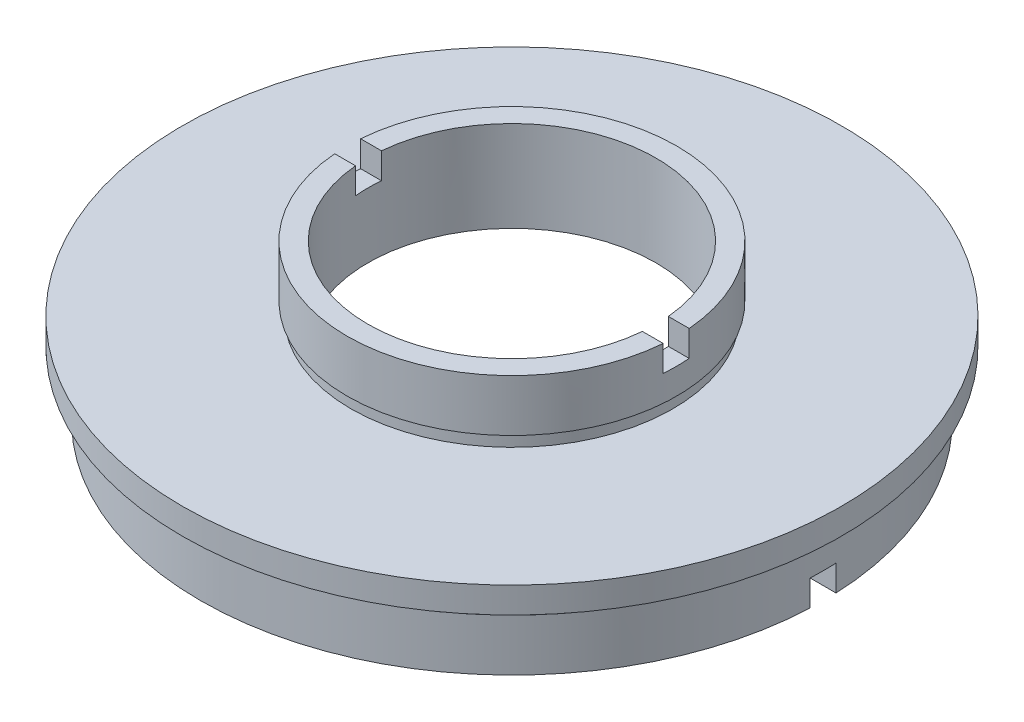
ISO-10303-21;
HEADER;
FILE_DESCRIPTION(('STEP AP214'),'2;1');
FILE_NAME('part.step','',(''),(''),'','','');
FILE_SCHEMA(('AUTOMOTIVE_DESIGN { 1 0 10303 214 1 1 1 1 }'));
ENDSEC;
DATA;
#1=APPLICATION_CONTEXT('core data for automotive mechanical design processes');
#2=APPLICATION_PROTOCOL_DEFINITION('international standard','automotive_design',2000,#1);
#3=PRODUCT_CONTEXT('',#1,'mechanical');
#4=PRODUCT('Part','Part','',(#3));
#5=PRODUCT_RELATED_PRODUCT_CATEGORY('part','',(#4));
#6=PRODUCT_DEFINITION_FORMATION('','',#4);
#7=PRODUCT_DEFINITION_CONTEXT('part definition',#1,'design');
#8=PRODUCT_DEFINITION('design','',#6,#7);
#9=PRODUCT_DEFINITION_SHAPE('','',#8);
#10=(LENGTH_UNIT() NAMED_UNIT(*) SI_UNIT(.MILLI.,.METRE.));
#11=(NAMED_UNIT(*) PLANE_ANGLE_UNIT() SI_UNIT($,.RADIAN.));
#12=(NAMED_UNIT(*) SI_UNIT($,.STERADIAN.) SOLID_ANGLE_UNIT());
#13=UNCERTAINTY_MEASURE_WITH_UNIT(LENGTH_MEASURE(1.E-05),#10,'distance_accuracy_value','');
#14=(GEOMETRIC_REPRESENTATION_CONTEXT(3) GLOBAL_UNCERTAINTY_ASSIGNED_CONTEXT((#13)) GLOBAL_UNIT_ASSIGNED_CONTEXT((#10,
#11,#12)) REPRESENTATION_CONTEXT('',''));
#15=CARTESIAN_POINT('',(0.,0.,0.));
#16=DIRECTION('',(0.,0.,1.));
#17=DIRECTION('',(1.,0.,0.));
#18=AXIS2_PLACEMENT_3D('',#15,#16,#17);
#19=CARTESIAN_POINT('',(-24.,0.,0.));
#20=DIRECTION('',(0.,-1.,0.));
#21=DIRECTION('',(0.,0.,-1.));
#22=AXIS2_PLACEMENT_3D('',#19,#20,#21);
#23=PLANE('',#22);
#24=DIRECTION('',(-1.,0.,0.));
#25=VECTOR('',#24,1.);
#26=CARTESIAN_POINT('',(-24.,0.,1.));
#27=LINE('',#26,#25);
#28=CARTESIAN_POINT('',(23.9791576165636,0.,1.));
#29=VERTEX_POINT('',#28);
#30=CARTESIAN_POINT('',(20.4755952294433,0.,1.));
#31=VERTEX_POINT('',#30);
#32=EDGE_CURVE('E183',#29,#31,#27,.T.);
#33=ORIENTED_EDGE('',*,*,#32,.F.);
#34=CARTESIAN_POINT('',(0.,0.,0.));
#35=DIRECTION('',(0.,1.,0.));
#36=DIRECTION('',(0.,0.,1.));
#37=AXIS2_PLACEMENT_3D('',#34,#35,#36);
#38=CIRCLE('',#37,24.);
#39=CARTESIAN_POINT('',(-23.9791576165636,0.,1.));
#40=VERTEX_POINT('',#39);
#41=EDGE_CURVE('E238',#40,#29,#38,.T.);
#42=ORIENTED_EDGE('',*,*,#41,.F.);
#43=CARTESIAN_POINT('',(-20.4755952294433,0.,1.));
#44=VERTEX_POINT('',#43);
#45=EDGE_CURVE('E161',#44,#40,#27,.T.);
#46=ORIENTED_EDGE('',*,*,#45,.F.);
#47=CARTESIAN_POINT('',(0.,0.,0.));
#48=DIRECTION('',(0.,1.,0.));
#49=DIRECTION('',(0.,0.,1.));
#50=AXIS2_PLACEMENT_3D('',#47,#48,#49);
#51=CIRCLE('',#50,20.5);
#52=EDGE_CURVE('E234',#44,#31,#51,.T.);
#53=ORIENTED_EDGE('',*,*,#52,.T.);
#54=EDGE_LOOP('',(#33,#42,#46,#53));
#55=FACE_BOUND('',#54,.T.);
#56=ADVANCED_FACE('F38',(#55),#23,.T.);
#57=CARTESIAN_POINT('',(-11.1,12.,0.));
#58=DIRECTION('',(0.,1.,0.));
#59=DIRECTION('',(0.,0.,1.));
#60=AXIS2_PLACEMENT_3D('',#57,#58,#59);
#61=PLANE('',#60);
#62=DIRECTION('',(1.,0.,0.));
#63=VECTOR('',#62,1.);
#64=CARTESIAN_POINT('',(-11.1,12.,1.));
#65=LINE('',#64,#63);
#66=CARTESIAN_POINT('',(-12.6605687076055,12.,1.));
#67=VERTEX_POINT('',#66);
#68=CARTESIAN_POINT('',(-11.054863183233,12.,1.));
#69=VERTEX_POINT('',#68);
#70=EDGE_CURVE('E270',#67,#69,#65,.T.);
#71=ORIENTED_EDGE('',*,*,#70,.F.);
#72=CARTESIAN_POINT('',(0.,12.,0.));
#73=DIRECTION('',(0.,1.,0.));
#74=DIRECTION('',(0.,0.,1.));
#75=AXIS2_PLACEMENT_3D('',#72,#73,#74);
#76=CIRCLE('',#75,12.7);
#77=CARTESIAN_POINT('',(12.6605687076055,12.,1.));
#78=VERTEX_POINT('',#77);
#79=EDGE_CURVE('E214',#67,#78,#76,.T.);
#80=ORIENTED_EDGE('',*,*,#79,.T.);
#81=CARTESIAN_POINT('',(11.054863183233,12.,1.));
#82=VERTEX_POINT('',#81);
#83=EDGE_CURVE('E268',#82,#78,#65,.T.);
#84=ORIENTED_EDGE('',*,*,#83,.F.);
#85=CARTESIAN_POINT('',(0.,12.,0.));
#86=DIRECTION('',(0.,1.,0.));
#87=DIRECTION('',(0.,0.,1.));
#88=AXIS2_PLACEMENT_3D('',#85,#86,#87);
#89=CIRCLE('',#88,11.1);
#90=EDGE_CURVE('E218',#69,#82,#89,.T.);
#91=ORIENTED_EDGE('',*,*,#90,.F.);
#92=EDGE_LOOP('',(#71,#80,#84,#91));
#93=FACE_BOUND('',#92,.T.);
#94=ADVANCED_FACE('F319',(#93),#61,.T.);
#95=CARTESIAN_POINT('',(0.,22.6774994510759,0.));
#96=DIRECTION('',(0.,1.,0.));
#97=DIRECTION('',(0.,0.,1.));
#98=AXIS2_PLACEMENT_3D('',#95,#96,#97);
#99=CYLINDRICAL_SURFACE('',#98,12.7);
#100=DIRECTION('',(0.,1.,0.));
#101=VECTOR('',#100,1.);
#102=CARTESIAN_POINT('',(-12.6605687076055,22.6774994510759,1.));
#103=LINE('',#102,#101);
#104=CARTESIAN_POINT('',(-12.6605687076055,10.,1.));
#105=VERTEX_POINT('',#104);
#106=EDGE_CURVE('E209',#105,#67,#103,.T.);
#107=ORIENTED_EDGE('',*,*,#106,.F.);
#108=CARTESIAN_POINT('',(0.,10.,0.));
#109=DIRECTION('',(0.,-1.,0.));
#110=DIRECTION('',(0.,0.,-1.));
#111=AXIS2_PLACEMENT_3D('',#108,#109,#110);
#112=CIRCLE('',#111,12.7);
#113=CARTESIAN_POINT('',(-12.6605687076055,10.,-0.999999999999997));
#114=VERTEX_POINT('',#113);
#115=EDGE_CURVE('E213',#114,#105,#112,.F.);
#116=ORIENTED_EDGE('',*,*,#115,.F.);
#117=DIRECTION('',(0.,1.,0.));
#118=VECTOR('',#117,1.);
#119=CARTESIAN_POINT('',(-12.6605687076055,22.6774994510759,-1.));
#120=LINE('',#119,#118);
#121=CARTESIAN_POINT('',(-12.6605687076055,12.,-0.999999999999998));
#122=VERTEX_POINT('',#121);
#123=EDGE_CURVE('E197',#122,#114,#120,.F.);
#124=ORIENTED_EDGE('',*,*,#123,.F.);
#125=CARTESIAN_POINT('',(12.6605687076055,12.,-0.999999999999998));
#126=VERTEX_POINT('',#125);
#127=EDGE_CURVE('E217',#126,#122,#76,.T.);
#128=ORIENTED_EDGE('',*,*,#127,.F.);
#129=DIRECTION('',(0.,1.,0.));
#130=VECTOR('',#129,1.);
#131=CARTESIAN_POINT('',(12.6605687076055,22.6774994510759,-1.));
#132=LINE('',#131,#130);
#133=CARTESIAN_POINT('',(12.6605687076055,10.,-0.999999999999997));
#134=VERTEX_POINT('',#133);
#135=EDGE_CURVE('E201',#134,#126,#132,.T.);
#136=ORIENTED_EDGE('',*,*,#135,.F.);
#137=CARTESIAN_POINT('',(12.6605687076055,10.,1.));
#138=VERTEX_POINT('',#137);
#139=EDGE_CURVE('E211',#138,#134,#112,.F.);
#140=ORIENTED_EDGE('',*,*,#139,.F.);
#141=DIRECTION('',(0.,1.,0.));
#142=VECTOR('',#141,1.);
#143=CARTESIAN_POINT('',(12.6605687076055,22.6774994510759,1.));
#144=LINE('',#143,#142);
#145=EDGE_CURVE('E205',#78,#138,#144,.F.);
#146=ORIENTED_EDGE('',*,*,#145,.F.);
#147=ORIENTED_EDGE('',*,*,#79,.F.);
#148=EDGE_LOOP('',(#107,#116,#124,#128,#136,#140,#146,#147));
#149=FACE_BOUND('',#148,.T.);
#150=CARTESIAN_POINT('',(0.,8.,0.));
#151=DIRECTION('',(0.,1.,0.));
#152=DIRECTION('',(0.,0.,1.));
#153=AXIS2_PLACEMENT_3D('',#150,#151,#152);
#154=CIRCLE('',#153,12.7);
#155=CARTESIAN_POINT('',(0.,8.,12.7));
#156=VERTEX_POINT('',#155);
#157=EDGE_CURVE('E262',#156,#156,#154,.T.);
#158=ORIENTED_EDGE('',*,*,#157,.T.);
#159=EDGE_LOOP('',(#158));
#160=FACE_BOUND('',#159,.T.);
#161=ADVANCED_FACE('F40',(#149,#160),#99,.T.);
#162=CARTESIAN_POINT('',(-12.7,8.,0.));
#163=DIRECTION('',(0.,-1.,0.));
#164=DIRECTION('',(0.,0.,-1.));
#165=AXIS2_PLACEMENT_3D('',#162,#163,#164);
#166=PLANE('',#165);
#167=CARTESIAN_POINT('',(0.,8.,0.));
#168=DIRECTION('',(0.,1.,0.));
#169=DIRECTION('',(0.,0.,1.));
#170=AXIS2_PLACEMENT_3D('',#167,#168,#169);
#171=CIRCLE('',#170,12.4);
#172=CARTESIAN_POINT('',(0.,8.,12.4));
#173=VERTEX_POINT('',#172);
#174=EDGE_CURVE('E259',#173,#173,#171,.T.);
#175=ORIENTED_EDGE('',*,*,#174,.T.);
#176=EDGE_LOOP('',(#175));
#177=FACE_BOUND('',#176,.T.);
#178=ORIENTED_EDGE('',*,*,#157,.F.);
#179=EDGE_LOOP('',(#178));
#180=FACE_BOUND('',#179,.T.);
#181=ADVANCED_FACE('F329',(#177,#180),#166,.T.);
#182=CARTESIAN_POINT('',(0.,22.6774994510759,0.));
#183=DIRECTION('',(0.,1.,0.));
#184=DIRECTION('',(0.,0.,1.));
#185=AXIS2_PLACEMENT_3D('',#182,#183,#184);
#186=CYLINDRICAL_SURFACE('',#185,12.4);
#187=CARTESIAN_POINT('',(0.,7.,0.));
#188=DIRECTION('',(0.,1.,0.));
#189=DIRECTION('',(0.,0.,1.));
#190=AXIS2_PLACEMENT_3D('',#187,#188,#189);
#191=CIRCLE('',#190,12.4);
#192=CARTESIAN_POINT('',(0.,7.,12.4));
#193=VERTEX_POINT('',#192);
#194=EDGE_CURVE('E256',#193,#193,#191,.T.);
#195=ORIENTED_EDGE('',*,*,#194,.T.);
#196=EDGE_LOOP('',(#195));
#197=FACE_BOUND('',#196,.T.);
#198=ORIENTED_EDGE('',*,*,#174,.F.);
#199=EDGE_LOOP('',(#198));
#200=FACE_BOUND('',#199,.T.);
#201=ADVANCED_FACE('F569',(#197,#200),#186,.T.);
#202=CARTESIAN_POINT('',(-12.4,7.,0.));
#203=DIRECTION('',(0.,1.,0.));
#204=DIRECTION('',(0.,0.,1.));
#205=AXIS2_PLACEMENT_3D('',#202,#203,#204);
#206=PLANE('',#205);
#207=CARTESIAN_POINT('',(0.,7.,0.));
#208=DIRECTION('',(0.,1.,0.));
#209=DIRECTION('',(0.,0.,1.));
#210=AXIS2_PLACEMENT_3D('',#207,#208,#209);
#211=CIRCLE('',#210,25.4);
#212=CARTESIAN_POINT('',(0.,7.,25.4));
#213=VERTEX_POINT('',#212);
#214=EDGE_CURVE('E253',#213,#213,#211,.T.);
#215=ORIENTED_EDGE('',*,*,#214,.T.);
#216=EDGE_LOOP('',(#215));
#217=FACE_BOUND('',#216,.T.);
#218=ORIENTED_EDGE('',*,*,#194,.F.);
#219=EDGE_LOOP('',(#218));
#220=FACE_BOUND('',#219,.T.);
#221=ADVANCED_FACE('F560',(#217,#220),#206,.T.);
#222=CARTESIAN_POINT('',(0.,22.6774994510759,0.));
#223=DIRECTION('',(0.,1.,0.));
#224=DIRECTION('',(0.,0.,1.));
#225=AXIS2_PLACEMENT_3D('',#222,#223,#224);
#226=CYLINDRICAL_SURFACE('',#225,25.4);
#227=CARTESIAN_POINT('',(0.,5.,0.));
#228=DIRECTION('',(0.,1.,0.));
#229=DIRECTION('',(0.,0.,1.));
#230=AXIS2_PLACEMENT_3D('',#227,#228,#229);
#231=CIRCLE('',#230,25.4);
#232=CARTESIAN_POINT('',(0.,5.,25.4));
#233=VERTEX_POINT('',#232);
#234=EDGE_CURVE('E250',#233,#233,#231,.T.);
#235=ORIENTED_EDGE('',*,*,#234,.T.);
#236=EDGE_LOOP('',(#235));
#237=FACE_BOUND('',#236,.T.);
#238=ORIENTED_EDGE('',*,*,#214,.F.);
#239=EDGE_LOOP('',(#238));
#240=FACE_BOUND('',#239,.T.);
#241=ADVANCED_FACE('F551',(#237,#240),#226,.T.);
#242=CARTESIAN_POINT('',(-25.4,5.,0.));
#243=DIRECTION('',(0.,-1.,0.));
#244=DIRECTION('',(0.,0.,-1.));
#245=AXIS2_PLACEMENT_3D('',#242,#243,#244);
#246=PLANE('',#245);
#247=CARTESIAN_POINT('',(0.,5.,0.));
#248=DIRECTION('',(0.,1.,0.));
#249=DIRECTION('',(0.,0.,1.));
#250=AXIS2_PLACEMENT_3D('',#247,#248,#249);
#251=CIRCLE('',#250,23.5);
#252=CARTESIAN_POINT('',(0.,5.,23.5));
#253=VERTEX_POINT('',#252);
#254=EDGE_CURVE('E247',#253,#253,#251,.T.);
#255=ORIENTED_EDGE('',*,*,#254,.T.);
#256=EDGE_LOOP('',(#255));
#257=FACE_BOUND('',#256,.T.);
#258=ORIENTED_EDGE('',*,*,#234,.F.);
#259=EDGE_LOOP('',(#258));
#260=FACE_BOUND('',#259,.T.);
#261=ADVANCED_FACE('F542',(#257,#260),#246,.T.);
#262=CARTESIAN_POINT('',(0.,22.6774994510759,0.));
#263=DIRECTION('',(0.,1.,0.));
#264=DIRECTION('',(0.,0.,1.));
#265=AXIS2_PLACEMENT_3D('',#262,#263,#264);
#266=CYLINDRICAL_SURFACE('',#265,23.5);
#267=CARTESIAN_POINT('',(0.,4.,0.));
#268=DIRECTION('',(0.,1.,0.));
#269=DIRECTION('',(0.,0.,1.));
#270=AXIS2_PLACEMENT_3D('',#267,#268,#269);
#271=CIRCLE('',#270,23.5);
#272=CARTESIAN_POINT('',(0.,4.,23.5));
#273=VERTEX_POINT('',#272);
#274=EDGE_CURVE('E244',#273,#273,#271,.T.);
#275=ORIENTED_EDGE('',*,*,#274,.T.);
#276=EDGE_LOOP('',(#275));
#277=FACE_BOUND('',#276,.T.);
#278=ORIENTED_EDGE('',*,*,#254,.F.);
#279=EDGE_LOOP('',(#278));
#280=FACE_BOUND('',#279,.T.);
#281=ADVANCED_FACE('F533',(#277,#280),#266,.T.);
#282=CARTESIAN_POINT('',(-23.5,4.,0.));
#283=DIRECTION('',(0.,1.,0.));
#284=DIRECTION('',(0.,0.,1.));
#285=AXIS2_PLACEMENT_3D('',#282,#283,#284);
#286=PLANE('',#285);
#287=CARTESIAN_POINT('',(0.,4.,0.));
#288=DIRECTION('',(0.,1.,0.));
#289=DIRECTION('',(0.,0.,1.));
#290=AXIS2_PLACEMENT_3D('',#287,#288,#289);
#291=CIRCLE('',#290,24.);
#292=CARTESIAN_POINT('',(0.,4.,24.));
#293=VERTEX_POINT('',#292);
#294=EDGE_CURVE('E241',#293,#293,#291,.T.);
#295=ORIENTED_EDGE('',*,*,#294,.T.);
#296=EDGE_LOOP('',(#295));
#297=FACE_BOUND('',#296,.T.);
#298=ORIENTED_EDGE('',*,*,#274,.F.);
#299=EDGE_LOOP('',(#298));
#300=FACE_BOUND('',#299,.T.);
#301=ADVANCED_FACE('F316',(#297,#300),#286,.T.);
#302=CARTESIAN_POINT('',(0.,22.6774994510759,0.));
#303=DIRECTION('',(0.,1.,0.));
#304=DIRECTION('',(0.,0.,1.));
#305=AXIS2_PLACEMENT_3D('',#302,#303,#304);
#306=CYLINDRICAL_SURFACE('',#305,24.);
#307=DIRECTION('',(0.,1.,0.));
#308=VECTOR('',#307,1.);
#309=CARTESIAN_POINT('',(-23.9791576165636,22.6774994510759,1.));
#310=LINE('',#309,#308);
#311=CARTESIAN_POINT('',(-23.9791576165636,2.,1.));
#312=VERTEX_POINT('',#311);
#313=EDGE_CURVE('E182',#40,#312,#310,.T.);
#314=ORIENTED_EDGE('',*,*,#313,.F.);
#315=ORIENTED_EDGE('',*,*,#41,.T.);
#316=DIRECTION('',(0.,1.,0.));
#317=VECTOR('',#316,1.);
#318=CARTESIAN_POINT('',(23.9791576165636,22.6774994510759,1.));
#319=LINE('',#318,#317);
#320=CARTESIAN_POINT('',(23.9791576165636,2.,1.));
#321=VERTEX_POINT('',#320);
#322=EDGE_CURVE('E185',#321,#29,#319,.F.);
#323=ORIENTED_EDGE('',*,*,#322,.F.);
#324=CARTESIAN_POINT('',(0.,2.,0.));
#325=DIRECTION('',(0.,1.,0.));
#326=DIRECTION('',(0.,0.,1.));
#327=AXIS2_PLACEMENT_3D('',#324,#325,#326);
#328=CIRCLE('',#327,24.);
#329=CARTESIAN_POINT('',(23.9791576165636,2.,-1.));
#330=VERTEX_POINT('',#329);
#331=EDGE_CURVE('E162',#330,#321,#328,.F.);
#332=ORIENTED_EDGE('',*,*,#331,.F.);
#333=DIRECTION('',(0.,1.,0.));
#334=VECTOR('',#333,1.);
#335=CARTESIAN_POINT('',(23.9791576165636,22.6774994510759,-0.999999999999994));
#336=LINE('',#335,#334);
#337=CARTESIAN_POINT('',(23.9791576165636,0.,-1.));
#338=VERTEX_POINT('',#337);
#339=EDGE_CURVE('E176',#338,#330,#336,.T.);
#340=ORIENTED_EDGE('',*,*,#339,.F.);
#341=CARTESIAN_POINT('',(-23.9791576165636,0.,-1.));
#342=VERTEX_POINT('',#341);
#343=EDGE_CURVE('E174',#338,#342,#38,.T.);
#344=ORIENTED_EDGE('',*,*,#343,.T.);
#345=DIRECTION('',(0.,1.,0.));
#346=VECTOR('',#345,1.);
#347=CARTESIAN_POINT('',(-23.9791576165636,22.6774994510759,-0.999999999999994));
#348=LINE('',#347,#346);
#349=CARTESIAN_POINT('',(-23.9791576165636,2.,-1.));
#350=VERTEX_POINT('',#349);
#351=EDGE_CURVE('E165',#350,#342,#348,.F.);
#352=ORIENTED_EDGE('',*,*,#351,.F.);
#353=EDGE_CURVE('E151',#312,#350,#328,.F.);
#354=ORIENTED_EDGE('',*,*,#353,.F.);
#355=EDGE_LOOP('',(#314,#315,#323,#332,#340,#344,#352,#354));
#356=FACE_BOUND('',#355,.T.);
#357=ORIENTED_EDGE('',*,*,#294,.F.);
#358=EDGE_LOOP('',(#357));
#359=FACE_BOUND('',#358,.T.);
#360=ADVANCED_FACE('F170',(#356,#359),#306,.T.);
#361=DIRECTION('',(1.,0.,0.));
#362=VECTOR('',#361,1.);
#363=CARTESIAN_POINT('',(-24.,0.,-1.));
#364=LINE('',#363,#362);
#365=CARTESIAN_POINT('',(-20.4755952294433,0.,-0.999999999999995));
#366=VERTEX_POINT('',#365);
#367=EDGE_CURVE('E61',#342,#366,#364,.T.);
#368=ORIENTED_EDGE('',*,*,#367,.F.);
#369=ORIENTED_EDGE('',*,*,#343,.F.);
#370=CARTESIAN_POINT('',(20.4755952294433,0.,-0.999999999999994));
#371=VERTEX_POINT('',#370);
#372=EDGE_CURVE('E178',#371,#338,#364,.T.);
#373=ORIENTED_EDGE('',*,*,#372,.F.);
#374=EDGE_CURVE('E237',#371,#366,#51,.T.);
#375=ORIENTED_EDGE('',*,*,#374,.T.);
#376=EDGE_LOOP('',(#368,#369,#373,#375));
#377=FACE_BOUND('',#376,.T.);
#378=ADVANCED_FACE('F307',(#377),#23,.T.);
#379=CARTESIAN_POINT('',(0.,22.6774994510759,0.));
#380=DIRECTION('',(0.,1.,0.));
#381=DIRECTION('',(0.,0.,1.));
#382=AXIS2_PLACEMENT_3D('',#379,#380,#381);
#383=CYLINDRICAL_SURFACE('',#382,20.5);
#384=DIRECTION('',(0.,1.,0.));
#385=VECTOR('',#384,1.);
#386=CARTESIAN_POINT('',(-20.4755952294433,22.6774994510759,1.));
#387=LINE('',#386,#385);
#388=CARTESIAN_POINT('',(-20.4755952294433,2.,1.));
#389=VERTEX_POINT('',#388);
#390=EDGE_CURVE('E12',#389,#44,#387,.F.);
#391=ORIENTED_EDGE('',*,*,#390,.F.);
#392=CARTESIAN_POINT('',(0.,2.,0.));
#393=DIRECTION('',(0.,1.,0.));
#394=DIRECTION('',(0.,0.,1.));
#395=AXIS2_PLACEMENT_3D('',#392,#393,#394);
#396=CIRCLE('',#395,20.5);
#397=CARTESIAN_POINT('',(-20.4755952294433,2.,-1.));
#398=VERTEX_POINT('',#397);
#399=EDGE_CURVE('E46',#398,#389,#396,.T.);
#400=ORIENTED_EDGE('',*,*,#399,.F.);
#401=DIRECTION('',(0.,1.,0.));
#402=VECTOR('',#401,1.);
#403=CARTESIAN_POINT('',(-20.4755952294433,22.6774994510759,-0.999999999999994));
#404=LINE('',#403,#402);
#405=EDGE_CURVE('E166',#366,#398,#404,.T.);
#406=ORIENTED_EDGE('',*,*,#405,.F.);
#407=ORIENTED_EDGE('',*,*,#374,.F.);
#408=DIRECTION('',(0.,1.,0.));
#409=VECTOR('',#408,1.);
#410=CARTESIAN_POINT('',(20.4755952294433,22.6774994510759,-0.999999999999994));
#411=LINE('',#410,#409);
#412=CARTESIAN_POINT('',(20.4755952294433,2.,-0.999999999999994));
#413=VERTEX_POINT('',#412);
#414=EDGE_CURVE('E274',#413,#371,#411,.F.);
#415=ORIENTED_EDGE('',*,*,#414,.F.);
#416=CARTESIAN_POINT('',(20.4755952294433,2.,1.));
#417=VERTEX_POINT('',#416);
#418=EDGE_CURVE('E276',#417,#413,#396,.T.);
#419=ORIENTED_EDGE('',*,*,#418,.F.);
#420=DIRECTION('',(0.,1.,0.));
#421=VECTOR('',#420,1.);
#422=CARTESIAN_POINT('',(20.4755952294433,22.6774994510759,1.));
#423=LINE('',#422,#421);
#424=EDGE_CURVE('E278',#31,#417,#423,.T.);
#425=ORIENTED_EDGE('',*,*,#424,.F.);
#426=ORIENTED_EDGE('',*,*,#52,.F.);
#427=EDGE_LOOP('',(#391,#400,#406,#407,#415,#419,#425,#426));
#428=FACE_BOUND('',#427,.T.);
#429=CARTESIAN_POINT('',(0.,4.,0.));
#430=DIRECTION('',(0.,1.,0.));
#431=DIRECTION('',(0.,0.,1.));
#432=AXIS2_PLACEMENT_3D('',#429,#430,#431);
#433=CIRCLE('',#432,20.5);
#434=CARTESIAN_POINT('',(0.,4.,20.5));
#435=VERTEX_POINT('',#434);
#436=EDGE_CURVE('E231',#435,#435,#433,.T.);
#437=ORIENTED_EDGE('',*,*,#436,.T.);
#438=EDGE_LOOP('',(#437));
#439=FACE_BOUND('',#438,.T.);
#440=ADVANCED_FACE('F286',(#428,#439),#383,.F.);
#441=CARTESIAN_POINT('',(-21.1,4.,0.));
#442=DIRECTION('',(0.,1.,0.));
#443=DIRECTION('',(0.,0.,1.));
#444=AXIS2_PLACEMENT_3D('',#441,#442,#443);
#445=PLANE('',#444);
#446=CARTESIAN_POINT('',(0.,4.,0.));
#447=DIRECTION('',(0.,1.,0.));
#448=DIRECTION('',(0.,0.,1.));
#449=AXIS2_PLACEMENT_3D('',#446,#447,#448);
#450=CIRCLE('',#449,21.1);
#451=CARTESIAN_POINT('',(0.,4.,21.1));
#452=VERTEX_POINT('',#451);
#453=EDGE_CURVE('E228',#452,#452,#450,.T.);
#454=ORIENTED_EDGE('',*,*,#453,.T.);
#455=EDGE_LOOP('',(#454));
#456=FACE_BOUND('',#455,.T.);
#457=ORIENTED_EDGE('',*,*,#436,.F.);
#458=EDGE_LOOP('',(#457));
#459=FACE_BOUND('',#458,.T.);
#460=ADVANCED_FACE('F314',(#456,#459),#445,.T.);
#461=CARTESIAN_POINT('',(0.,22.6774994510759,0.));
#462=DIRECTION('',(0.,1.,0.));
#463=DIRECTION('',(0.,0.,1.));
#464=AXIS2_PLACEMENT_3D('',#461,#462,#463);
#465=CYLINDRICAL_SURFACE('',#464,21.1);
#466=CARTESIAN_POINT('',(0.,5.,0.));
#467=DIRECTION('',(0.,1.,0.));
#468=DIRECTION('',(0.,0.,1.));
#469=AXIS2_PLACEMENT_3D('',#466,#467,#468);
#470=CIRCLE('',#469,21.1);
#471=CARTESIAN_POINT('',(0.,5.,21.1));
#472=VERTEX_POINT('',#471);
#473=EDGE_CURVE('E225',#472,#472,#470,.T.);
#474=ORIENTED_EDGE('',*,*,#473,.T.);
#475=EDGE_LOOP('',(#474));
#476=FACE_BOUND('',#475,.T.);
#477=ORIENTED_EDGE('',*,*,#453,.F.);
#478=EDGE_LOOP('',(#477));
#479=FACE_BOUND('',#478,.T.);
#480=ADVANCED_FACE('F492',(#476,#479),#465,.F.);
#481=CARTESIAN_POINT('',(-11.1,5.,0.));
#482=DIRECTION('',(0.,-1.,0.));
#483=DIRECTION('',(0.,0.,-1.));
#484=AXIS2_PLACEMENT_3D('',#481,#482,#483);
#485=PLANE('',#484);
#486=CARTESIAN_POINT('',(0.,5.,0.));
#487=DIRECTION('',(0.,1.,0.));
#488=DIRECTION('',(0.,0.,1.));
#489=AXIS2_PLACEMENT_3D('',#486,#487,#488);
#490=CIRCLE('',#489,11.1);
#491=CARTESIAN_POINT('',(0.,5.,11.1));
#492=VERTEX_POINT('',#491);
#493=EDGE_CURVE('E222',#492,#492,#490,.T.);
#494=ORIENTED_EDGE('',*,*,#493,.T.);
#495=EDGE_LOOP('',(#494));
#496=FACE_BOUND('',#495,.T.);
#497=ORIENTED_EDGE('',*,*,#473,.F.);
#498=EDGE_LOOP('',(#497));
#499=FACE_BOUND('',#498,.T.);
#500=ADVANCED_FACE('F345',(#496,#499),#485,.T.);
#501=CARTESIAN_POINT('',(0.,22.6774994510759,0.));
#502=DIRECTION('',(0.,1.,0.));
#503=DIRECTION('',(0.,0.,1.));
#504=AXIS2_PLACEMENT_3D('',#501,#502,#503);
#505=CYLINDRICAL_SURFACE('',#504,11.1);
#506=DIRECTION('',(0.,1.,0.));
#507=VECTOR('',#506,1.);
#508=CARTESIAN_POINT('',(11.054863183233,22.6774994510759,1.));
#509=LINE('',#508,#507);
#510=CARTESIAN_POINT('',(11.054863183233,10.,1.));
#511=VERTEX_POINT('',#510);
#512=EDGE_CURVE('E203',#511,#82,#509,.T.);
#513=ORIENTED_EDGE('',*,*,#512,.F.);
#514=CARTESIAN_POINT('',(0.,10.,0.));
#515=DIRECTION('',(0.,-1.,0.));
#516=DIRECTION('',(0.,0.,-1.));
#517=AXIS2_PLACEMENT_3D('',#514,#515,#516);
#518=CIRCLE('',#517,11.1);
#519=CARTESIAN_POINT('',(11.054863183233,10.,-0.999999999999997));
#520=VERTEX_POINT('',#519);
#521=EDGE_CURVE('E273',#520,#511,#518,.T.);
#522=ORIENTED_EDGE('',*,*,#521,.F.);
#523=DIRECTION('',(0.,1.,0.));
#524=VECTOR('',#523,1.);
#525=CARTESIAN_POINT('',(11.054863183233,22.6774994510759,-1.));
#526=LINE('',#525,#524);
#527=CARTESIAN_POINT('',(11.054863183233,12.,-0.999999999999998));
#528=VERTEX_POINT('',#527);
#529=EDGE_CURVE('E199',#528,#520,#526,.F.);
#530=ORIENTED_EDGE('',*,*,#529,.F.);
#531=CARTESIAN_POINT('',(-11.054863183233,12.,-0.999999999999998));
#532=VERTEX_POINT('',#531);
#533=EDGE_CURVE('E221',#528,#532,#89,.T.);
#534=ORIENTED_EDGE('',*,*,#533,.T.);
#535=DIRECTION('',(0.,1.,0.));
#536=VECTOR('',#535,1.);
#537=CARTESIAN_POINT('',(-11.054863183233,22.6774994510759,-1.));
#538=LINE('',#537,#536);
#539=CARTESIAN_POINT('',(-11.054863183233,10.,-0.999999999999997));
#540=VERTEX_POINT('',#539);
#541=EDGE_CURVE('E195',#540,#532,#538,.T.);
#542=ORIENTED_EDGE('',*,*,#541,.F.);
#543=CARTESIAN_POINT('',(-11.054863183233,10.,1.));
#544=VERTEX_POINT('',#543);
#545=EDGE_CURVE('E271',#544,#540,#518,.T.);
#546=ORIENTED_EDGE('',*,*,#545,.F.);
#547=DIRECTION('',(0.,1.,0.));
#548=VECTOR('',#547,1.);
#549=CARTESIAN_POINT('',(-11.054863183233,22.6774994510759,1.));
#550=LINE('',#549,#548);
#551=EDGE_CURVE('E207',#69,#544,#550,.F.);
#552=ORIENTED_EDGE('',*,*,#551,.F.);
#553=ORIENTED_EDGE('',*,*,#90,.T.);
#554=EDGE_LOOP('',(#513,#522,#530,#534,#542,#546,#552,#553));
#555=FACE_BOUND('',#554,.T.);
#556=ORIENTED_EDGE('',*,*,#493,.F.);
#557=EDGE_LOOP('',(#556));
#558=FACE_BOUND('',#557,.T.);
#559=ADVANCED_FACE('F336',(#555,#558),#505,.F.);
#560=DIRECTION('',(-1.,0.,0.));
#561=VECTOR('',#560,1.);
#562=CARTESIAN_POINT('',(-11.1,12.,-0.999999999999998));
#563=LINE('',#562,#561);
#564=EDGE_CURVE('E267',#126,#528,#563,.T.);
#565=ORIENTED_EDGE('',*,*,#564,.F.);
#566=ORIENTED_EDGE('',*,*,#127,.T.);
#567=EDGE_CURVE('E265',#532,#122,#563,.T.);
#568=ORIENTED_EDGE('',*,*,#567,.F.);
#569=ORIENTED_EDGE('',*,*,#533,.F.);
#570=EDGE_LOOP('',(#565,#566,#568,#569));
#571=FACE_BOUND('',#570,.T.);
#572=ADVANCED_FACE('F325',(#571),#61,.T.);
#573=CARTESIAN_POINT('',(-39.5,13.5939878717808,1.));
#574=DIRECTION('',(0.,0.,1.));
#575=DIRECTION('',(0.,-1.,0.));
#576=AXIS2_PLACEMENT_3D('',#573,#574,#575);
#577=PLANE('',#576);
#578=ORIENTED_EDGE('',*,*,#106,.T.);
#579=ORIENTED_EDGE('',*,*,#70,.T.);
#580=ORIENTED_EDGE('',*,*,#551,.T.);
#581=DIRECTION('',(1.,0.,0.));
#582=VECTOR('',#581,1.);
#583=CARTESIAN_POINT('',(-39.5,10.,1.));
#584=LINE('',#583,#582);
#585=EDGE_CURVE('E192',#105,#544,#584,.T.);
#586=ORIENTED_EDGE('',*,*,#585,.F.);
#587=EDGE_LOOP('',(#578,#579,#580,#586));
#588=FACE_BOUND('',#587,.T.);
#589=ADVANCED_FACE('F335',(#588),#577,.F.);
#590=CARTESIAN_POINT('',(-39.5,13.5939878717808,-0.999999999999998));
#591=DIRECTION('',(0.,0.,-1.));
#592=DIRECTION('',(0.,1.,0.));
#593=AXIS2_PLACEMENT_3D('',#590,#591,#592);
#594=PLANE('',#593);
#595=ORIENTED_EDGE('',*,*,#123,.T.);
#596=DIRECTION('',(1.,0.,0.));
#597=VECTOR('',#596,1.);
#598=CARTESIAN_POINT('',(-39.5,10.,-0.999999999999997));
#599=LINE('',#598,#597);
#600=EDGE_CURVE('E191',#114,#540,#599,.T.);
#601=ORIENTED_EDGE('',*,*,#600,.T.);
#602=ORIENTED_EDGE('',*,*,#541,.T.);
#603=ORIENTED_EDGE('',*,*,#567,.T.);
#604=EDGE_LOOP('',(#595,#601,#602,#603));
#605=FACE_BOUND('',#604,.T.);
#606=ADVANCED_FACE('F342',(#605),#594,.F.);
#607=CARTESIAN_POINT('',(-39.5,10.,1.));
#608=DIRECTION('',(0.,-1.,0.));
#609=DIRECTION('',(0.,0.,-1.));
#610=AXIS2_PLACEMENT_3D('',#607,#608,#609);
#611=PLANE('',#610);
#612=ORIENTED_EDGE('',*,*,#115,.T.);
#613=ORIENTED_EDGE('',*,*,#585,.T.);
#614=ORIENTED_EDGE('',*,*,#545,.T.);
#615=ORIENTED_EDGE('',*,*,#600,.F.);
#616=EDGE_LOOP('',(#612,#613,#614,#615));
#617=FACE_BOUND('',#616,.T.);
#618=ADVANCED_FACE('F366',(#617),#611,.F.);
#619=ORIENTED_EDGE('',*,*,#139,.T.);
#620=EDGE_CURVE('E188',#520,#134,#599,.T.);
#621=ORIENTED_EDGE('',*,*,#620,.F.);
#622=ORIENTED_EDGE('',*,*,#521,.T.);
#623=EDGE_CURVE('E187',#511,#138,#584,.T.);
#624=ORIENTED_EDGE('',*,*,#623,.T.);
#625=EDGE_LOOP('',(#619,#621,#622,#624));
#626=FACE_BOUND('',#625,.T.);
#627=ADVANCED_FACE('F378',(#626),#611,.F.);
#628=ORIENTED_EDGE('',*,*,#135,.T.);
#629=ORIENTED_EDGE('',*,*,#564,.T.);
#630=ORIENTED_EDGE('',*,*,#529,.T.);
#631=ORIENTED_EDGE('',*,*,#620,.T.);
#632=EDGE_LOOP('',(#628,#629,#630,#631));
#633=FACE_BOUND('',#632,.T.);
#634=ADVANCED_FACE('F376',(#633),#594,.F.);
#635=ORIENTED_EDGE('',*,*,#145,.T.);
#636=ORIENTED_EDGE('',*,*,#623,.F.);
#637=ORIENTED_EDGE('',*,*,#512,.T.);
#638=ORIENTED_EDGE('',*,*,#83,.T.);
#639=EDGE_LOOP('',(#635,#636,#637,#638));
#640=FACE_BOUND('',#639,.T.);
#641=ADVANCED_FACE('F344',(#640),#577,.F.);
#642=CARTESIAN_POINT('',(-39.5,2.,-1.));
#643=DIRECTION('',(0.,0.,-1.));
#644=DIRECTION('',(0.,1.,0.));
#645=AXIS2_PLACEMENT_3D('',#642,#643,#644);
#646=PLANE('',#645);
#647=ORIENTED_EDGE('',*,*,#339,.T.);
#648=DIRECTION('',(1.,0.,0.));
#649=VECTOR('',#648,1.);
#650=CARTESIAN_POINT('',(-39.5,2.,-1.));
#651=LINE('',#650,#649);
#652=EDGE_CURVE('E53',#413,#330,#651,.T.);
#653=ORIENTED_EDGE('',*,*,#652,.F.);
#654=ORIENTED_EDGE('',*,*,#414,.T.);
#655=ORIENTED_EDGE('',*,*,#372,.T.);
#656=EDGE_LOOP('',(#647,#653,#654,#655));
#657=FACE_BOUND('',#656,.T.);
#658=ADVANCED_FACE('F301',(#657),#646,.F.);
#659=CARTESIAN_POINT('',(-39.5,2.,1.));
#660=DIRECTION('',(0.,1.,0.));
#661=DIRECTION('',(0.,0.,1.));
#662=AXIS2_PLACEMENT_3D('',#659,#660,#661);
#663=PLANE('',#662);
#664=ORIENTED_EDGE('',*,*,#331,.T.);
#665=DIRECTION('',(1.,0.,0.));
#666=VECTOR('',#665,1.);
#667=CARTESIAN_POINT('',(-39.5,2.,1.));
#668=LINE('',#667,#666);
#669=EDGE_CURVE('E167',#417,#321,#668,.T.);
#670=ORIENTED_EDGE('',*,*,#669,.F.);
#671=ORIENTED_EDGE('',*,*,#418,.T.);
#672=ORIENTED_EDGE('',*,*,#652,.T.);
#673=EDGE_LOOP('',(#664,#670,#671,#672));
#674=FACE_BOUND('',#673,.T.);
#675=ADVANCED_FACE('F302',(#674),#663,.F.);
#676=CARTESIAN_POINT('',(-39.5,2.,1.));
#677=DIRECTION('',(0.,0.,1.));
#678=DIRECTION('',(0.,-1.,0.));
#679=AXIS2_PLACEMENT_3D('',#676,#677,#678);
#680=PLANE('',#679);
#681=ORIENTED_EDGE('',*,*,#322,.T.);
#682=ORIENTED_EDGE('',*,*,#32,.T.);
#683=ORIENTED_EDGE('',*,*,#424,.T.);
#684=ORIENTED_EDGE('',*,*,#669,.T.);
#685=EDGE_LOOP('',(#681,#682,#683,#684));
#686=FACE_BOUND('',#685,.T.);
#687=ADVANCED_FACE('F297',(#686),#680,.F.);
#688=ORIENTED_EDGE('',*,*,#351,.T.);
#689=ORIENTED_EDGE('',*,*,#367,.T.);
#690=ORIENTED_EDGE('',*,*,#405,.T.);
#691=EDGE_CURVE('E154',#350,#398,#651,.T.);
#692=ORIENTED_EDGE('',*,*,#691,.F.);
#693=EDGE_LOOP('',(#688,#689,#690,#692));
#694=FACE_BOUND('',#693,.T.);
#695=ADVANCED_FACE('F164',(#694),#646,.F.);
#696=ORIENTED_EDGE('',*,*,#313,.T.);
#697=EDGE_CURVE('E157',#312,#389,#668,.T.);
#698=ORIENTED_EDGE('',*,*,#697,.T.);
#699=ORIENTED_EDGE('',*,*,#390,.T.);
#700=ORIENTED_EDGE('',*,*,#45,.T.);
#701=EDGE_LOOP('',(#696,#698,#699,#700));
#702=FACE_BOUND('',#701,.T.);
#703=ADVANCED_FACE('F282',(#702),#680,.F.);
#704=ORIENTED_EDGE('',*,*,#353,.T.);
#705=ORIENTED_EDGE('',*,*,#691,.T.);
#706=ORIENTED_EDGE('',*,*,#399,.T.);
#707=ORIENTED_EDGE('',*,*,#697,.F.);
#708=EDGE_LOOP('',(#704,#705,#706,#707));
#709=FACE_BOUND('',#708,.T.);
#710=ADVANCED_FACE('F153',(#709),#663,.F.);
#711=CLOSED_SHELL('',(#56,#94,#161,#181,#201,#221,#241,#261,#281,#301,#360,#378,#440,#460,#480,
#500,#559,#572,#589,#606,#618,#627,#634,#641,#658,#675,#687,#695,#703,#710));
#712=MANIFOLD_SOLID_BREP('B2',#711);
#713=ADVANCED_BREP_SHAPE_REPRESENTATION('',(#18,#712),#14);
#714=SHAPE_DEFINITION_REPRESENTATION(#9,#713);
ENDSEC;
END-ISO-10303-21;
